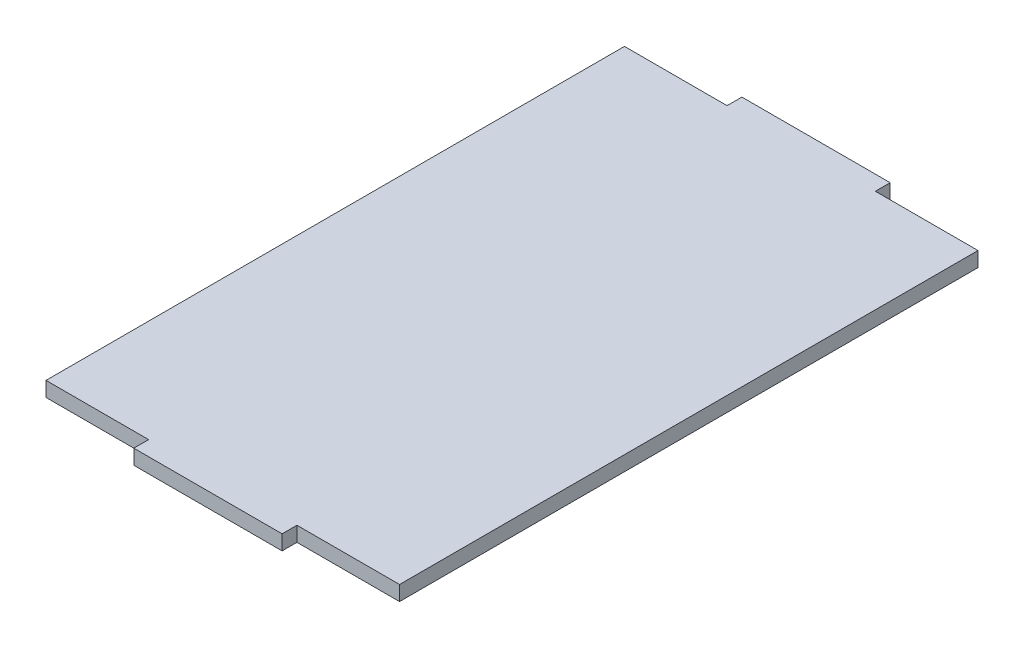
ISO-10303-21;
HEADER;
FILE_DESCRIPTION(('STEP AP214'),'2;1');
FILE_NAME('part.step','',(''),(''),'','','');
FILE_SCHEMA(('AUTOMOTIVE_DESIGN { 1 0 10303 214 1 1 1 1 }'));
ENDSEC;
DATA;
#1=APPLICATION_CONTEXT('core data for automotive mechanical design processes');
#2=APPLICATION_PROTOCOL_DEFINITION('international standard','automotive_design',2000,#1);
#3=PRODUCT_CONTEXT('',#1,'mechanical');
#4=PRODUCT('Part','Part','',(#3));
#5=PRODUCT_RELATED_PRODUCT_CATEGORY('part','',(#4));
#6=PRODUCT_DEFINITION_FORMATION('','',#4);
#7=PRODUCT_DEFINITION_CONTEXT('part definition',#1,'design');
#8=PRODUCT_DEFINITION('design','',#6,#7);
#9=PRODUCT_DEFINITION_SHAPE('','',#8);
#10=(LENGTH_UNIT() NAMED_UNIT(*) SI_UNIT(.MILLI.,.METRE.));
#11=(NAMED_UNIT(*) PLANE_ANGLE_UNIT() SI_UNIT($,.RADIAN.));
#12=(NAMED_UNIT(*) SI_UNIT($,.STERADIAN.) SOLID_ANGLE_UNIT());
#13=UNCERTAINTY_MEASURE_WITH_UNIT(LENGTH_MEASURE(1.E-05),#10,'distance_accuracy_value','');
#14=(GEOMETRIC_REPRESENTATION_CONTEXT(3) GLOBAL_UNCERTAINTY_ASSIGNED_CONTEXT((#13)) GLOBAL_UNIT_ASSIGNED_CONTEXT((#10,
#11,#12)) REPRESENTATION_CONTEXT('',''));
#15=CARTESIAN_POINT('',(0.,0.,0.));
#16=DIRECTION('',(0.,0.,1.));
#17=DIRECTION('',(1.,0.,0.));
#18=AXIS2_PLACEMENT_3D('',#15,#16,#17);
#19=CARTESIAN_POINT('',(-38.1561117317202,3.,-26.188327609225));
#20=DIRECTION('',(1.,0.,0.));
#21=DIRECTION('',(0.,0.,-1.));
#22=AXIS2_PLACEMENT_3D('',#19,#20,#21);
#23=PLANE('',#22);
#24=DIRECTION('',(0.,0.,1.));
#25=VECTOR('',#24,1.);
#26=CARTESIAN_POINT('',(-38.1561117317202,0.,-26.188327609225));
#27=LINE('',#26,#25);
#28=CARTESIAN_POINT('',(-38.1561117317202,0.,-26.188327609225));
#29=VERTEX_POINT('',#28);
#30=CARTESIAN_POINT('',(-38.1561117317202,0.,90.811672390775));
#31=VERTEX_POINT('',#30);
#32=EDGE_CURVE('E152',#29,#31,#27,.T.);
#33=ORIENTED_EDGE('',*,*,#32,.T.);
#34=DIRECTION('',(0.,-1.,0.));
#35=VECTOR('',#34,1.);
#36=CARTESIAN_POINT('',(-38.1561117317202,3.,90.811672390775));
#37=LINE('',#36,#35);
#38=CARTESIAN_POINT('',(-38.1561117317202,3.,90.811672390775));
#39=VERTEX_POINT('',#38);
#40=EDGE_CURVE('E11',#39,#31,#37,.T.);
#41=ORIENTED_EDGE('',*,*,#40,.F.);
#42=DIRECTION('',(0.,0.,1.));
#43=VECTOR('',#42,1.);
#44=CARTESIAN_POINT('',(-38.1561117317202,3.,-26.188327609225));
#45=LINE('',#44,#43);
#46=CARTESIAN_POINT('',(-38.1561117317202,3.,-26.188327609225));
#47=VERTEX_POINT('',#46);
#48=EDGE_CURVE('E174',#47,#39,#45,.T.);
#49=ORIENTED_EDGE('',*,*,#48,.F.);
#50=DIRECTION('',(0.,-1.,0.));
#51=VECTOR('',#50,1.);
#52=CARTESIAN_POINT('',(-38.1561117317202,3.,-26.188327609225));
#53=LINE('',#52,#51);
#54=EDGE_CURVE('E148',#47,#29,#53,.T.);
#55=ORIENTED_EDGE('',*,*,#54,.T.);
#56=EDGE_LOOP('',(#33,#41,#49,#55));
#57=FACE_BOUND('',#56,.T.);
#58=ADVANCED_FACE('F32',(#57),#23,.F.);
#59=CARTESIAN_POINT('',(-38.1561117317202,3.,90.811672390775));
#60=DIRECTION('',(0.,0.,-1.));
#61=DIRECTION('',(-1.,0.,0.));
#62=AXIS2_PLACEMENT_3D('',#59,#60,#61);
#63=PLANE('',#62);
#64=DIRECTION('',(1.,0.,0.));
#65=VECTOR('',#64,1.);
#66=CARTESIAN_POINT('',(-38.1561117317202,0.,90.811672390775));
#67=LINE('',#66,#65);
#68=CARTESIAN_POINT('',(-17.4011117317202,0.,90.811672390775));
#69=VERTEX_POINT('',#68);
#70=EDGE_CURVE('E155',#31,#69,#67,.T.);
#71=ORIENTED_EDGE('',*,*,#70,.T.);
#72=DIRECTION('',(0.,-1.,0.));
#73=VECTOR('',#72,1.);
#74=CARTESIAN_POINT('',(-17.4011117317202,3.,90.811672390775));
#75=LINE('',#74,#73);
#76=CARTESIAN_POINT('',(-17.4011117317202,3.,90.811672390775));
#77=VERTEX_POINT('',#76);
#78=EDGE_CURVE('E40',#77,#69,#75,.T.);
#79=ORIENTED_EDGE('',*,*,#78,.F.);
#80=DIRECTION('',(1.,0.,0.));
#81=VECTOR('',#80,1.);
#82=CARTESIAN_POINT('',(-38.1561117317202,3.,90.811672390775));
#83=LINE('',#82,#81);
#84=EDGE_CURVE('E103',#39,#77,#83,.T.);
#85=ORIENTED_EDGE('',*,*,#84,.F.);
#86=ORIENTED_EDGE('',*,*,#40,.T.);
#87=EDGE_LOOP('',(#71,#79,#85,#86));
#88=FACE_BOUND('',#87,.T.);
#89=ADVANCED_FACE('F252',(#88),#63,.F.);
#90=CARTESIAN_POINT('',(-17.4011117317202,3.,90.811672390775));
#91=DIRECTION('',(1.,0.,0.));
#92=DIRECTION('',(0.,0.,-1.));
#93=AXIS2_PLACEMENT_3D('',#90,#91,#92);
#94=PLANE('',#93);
#95=DIRECTION('',(0.,0.,1.));
#96=VECTOR('',#95,1.);
#97=CARTESIAN_POINT('',(-17.4011117317202,0.,90.811672390775));
#98=LINE('',#97,#96);
#99=CARTESIAN_POINT('',(-17.4011117317202,0.,93.811672390775));
#100=VERTEX_POINT('',#99);
#101=EDGE_CURVE('E157',#69,#100,#98,.T.);
#102=ORIENTED_EDGE('',*,*,#101,.T.);
#103=DIRECTION('',(0.,-1.,0.));
#104=VECTOR('',#103,1.);
#105=CARTESIAN_POINT('',(-17.4011117317202,3.,93.811672390775));
#106=LINE('',#105,#104);
#107=CARTESIAN_POINT('',(-17.4011117317202,3.,93.811672390775));
#108=VERTEX_POINT('',#107);
#109=EDGE_CURVE('E193',#108,#100,#106,.T.);
#110=ORIENTED_EDGE('',*,*,#109,.F.);
#111=DIRECTION('',(0.,0.,1.));
#112=VECTOR('',#111,1.);
#113=CARTESIAN_POINT('',(-17.4011117317202,3.,90.811672390775));
#114=LINE('',#113,#112);
#115=EDGE_CURVE('E201',#77,#108,#114,.T.);
#116=ORIENTED_EDGE('',*,*,#115,.F.);
#117=ORIENTED_EDGE('',*,*,#78,.T.);
#118=EDGE_LOOP('',(#102,#110,#116,#117));
#119=FACE_BOUND('',#118,.T.);
#120=ADVANCED_FACE('F199',(#119),#94,.F.);
#121=CARTESIAN_POINT('',(-17.4011117317202,3.,93.811672390775));
#122=DIRECTION('',(0.,0.,-1.));
#123=DIRECTION('',(-1.,0.,0.));
#124=AXIS2_PLACEMENT_3D('',#121,#122,#123);
#125=PLANE('',#124);
#126=DIRECTION('',(1.,0.,0.));
#127=VECTOR('',#126,1.);
#128=CARTESIAN_POINT('',(-17.4011117317202,0.,93.811672390775));
#129=LINE('',#128,#127);
#130=CARTESIAN_POINT('',(12.5988882682798,0.,93.811672390775));
#131=VERTEX_POINT('',#130);
#132=EDGE_CURVE('E159',#100,#131,#129,.T.);
#133=ORIENTED_EDGE('',*,*,#132,.T.);
#134=DIRECTION('',(0.,-1.,0.));
#135=VECTOR('',#134,1.);
#136=CARTESIAN_POINT('',(12.5988882682798,3.,93.811672390775));
#137=LINE('',#136,#135);
#138=CARTESIAN_POINT('',(12.5988882682798,3.,93.811672390775));
#139=VERTEX_POINT('',#138);
#140=EDGE_CURVE('E190',#139,#131,#137,.T.);
#141=ORIENTED_EDGE('',*,*,#140,.F.);
#142=DIRECTION('',(1.,0.,0.));
#143=VECTOR('',#142,1.);
#144=CARTESIAN_POINT('',(-17.4011117317202,3.,93.811672390775));
#145=LINE('',#144,#143);
#146=EDGE_CURVE('E219',#108,#139,#145,.T.);
#147=ORIENTED_EDGE('',*,*,#146,.F.);
#148=ORIENTED_EDGE('',*,*,#109,.T.);
#149=EDGE_LOOP('',(#133,#141,#147,#148));
#150=FACE_BOUND('',#149,.T.);
#151=ADVANCED_FACE('F210',(#150),#125,.F.);
#152=CARTESIAN_POINT('',(12.5988882682798,3.,90.811672390775));
#153=DIRECTION('',(-1.,0.,0.));
#154=DIRECTION('',(0.,0.,1.));
#155=AXIS2_PLACEMENT_3D('',#152,#153,#154);
#156=PLANE('',#155);
#157=DIRECTION('',(0.,0.,-1.));
#158=VECTOR('',#157,1.);
#159=CARTESIAN_POINT('',(12.5988882682798,0.,90.811672390775));
#160=LINE('',#159,#158);
#161=CARTESIAN_POINT('',(12.5988882682798,0.,90.811672390775));
#162=VERTEX_POINT('',#161);
#163=EDGE_CURVE('E161',#131,#162,#160,.T.);
#164=ORIENTED_EDGE('',*,*,#163,.T.);
#165=DIRECTION('',(0.,-1.,0.));
#166=VECTOR('',#165,1.);
#167=CARTESIAN_POINT('',(12.5988882682798,3.,90.811672390775));
#168=LINE('',#167,#166);
#169=CARTESIAN_POINT('',(12.5988882682798,3.,90.811672390775));
#170=VERTEX_POINT('',#169);
#171=EDGE_CURVE('E187',#170,#162,#168,.T.);
#172=ORIENTED_EDGE('',*,*,#171,.F.);
#173=DIRECTION('',(0.,0.,-1.));
#174=VECTOR('',#173,1.);
#175=CARTESIAN_POINT('',(12.5988882682798,3.,90.811672390775));
#176=LINE('',#175,#174);
#177=EDGE_CURVE('E216',#139,#170,#176,.T.);
#178=ORIENTED_EDGE('',*,*,#177,.F.);
#179=ORIENTED_EDGE('',*,*,#140,.T.);
#180=EDGE_LOOP('',(#164,#172,#178,#179));
#181=FACE_BOUND('',#180,.T.);
#182=ADVANCED_FACE('F214',(#181),#156,.F.);
#183=CARTESIAN_POINT('',(12.5988882682798,3.,90.811672390775));
#184=DIRECTION('',(0.,0.,-1.));
#185=DIRECTION('',(-1.,0.,0.));
#186=AXIS2_PLACEMENT_3D('',#183,#184,#185);
#187=PLANE('',#186);
#188=DIRECTION('',(1.,0.,0.));
#189=VECTOR('',#188,1.);
#190=CARTESIAN_POINT('',(12.5988882682798,0.,90.811672390775));
#191=LINE('',#190,#189);
#192=CARTESIAN_POINT('',(33.3538882682798,0.,90.811672390775));
#193=VERTEX_POINT('',#192);
#194=EDGE_CURVE('E163',#162,#193,#191,.T.);
#195=ORIENTED_EDGE('',*,*,#194,.T.);
#196=DIRECTION('',(0.,-1.,0.));
#197=VECTOR('',#196,1.);
#198=CARTESIAN_POINT('',(33.3538882682798,3.,90.811672390775));
#199=LINE('',#198,#197);
#200=CARTESIAN_POINT('',(33.3538882682798,3.,90.811672390775));
#201=VERTEX_POINT('',#200);
#202=EDGE_CURVE('E184',#201,#193,#199,.T.);
#203=ORIENTED_EDGE('',*,*,#202,.F.);
#204=DIRECTION('',(1.,0.,0.));
#205=VECTOR('',#204,1.);
#206=CARTESIAN_POINT('',(12.5988882682798,3.,90.811672390775));
#207=LINE('',#206,#205);
#208=EDGE_CURVE('E218',#170,#201,#207,.T.);
#209=ORIENTED_EDGE('',*,*,#208,.F.);
#210=ORIENTED_EDGE('',*,*,#171,.T.);
#211=EDGE_LOOP('',(#195,#203,#209,#210));
#212=FACE_BOUND('',#211,.T.);
#213=ADVANCED_FACE('F265',(#212),#187,.F.);
#214=CARTESIAN_POINT('',(33.3538882682798,3.,-26.188327609225));
#215=DIRECTION('',(-1.,0.,0.));
#216=DIRECTION('',(0.,0.,1.));
#217=AXIS2_PLACEMENT_3D('',#214,#215,#216);
#218=PLANE('',#217);
#219=DIRECTION('',(0.,0.,-1.));
#220=VECTOR('',#219,1.);
#221=CARTESIAN_POINT('',(33.3538882682798,0.,-26.188327609225));
#222=LINE('',#221,#220);
#223=CARTESIAN_POINT('',(33.3538882682798,0.,-26.188327609225));
#224=VERTEX_POINT('',#223);
#225=EDGE_CURVE('E165',#193,#224,#222,.T.);
#226=ORIENTED_EDGE('',*,*,#225,.T.);
#227=DIRECTION('',(0.,-1.,0.));
#228=VECTOR('',#227,1.);
#229=CARTESIAN_POINT('',(33.3538882682798,3.,-26.188327609225));
#230=LINE('',#229,#228);
#231=CARTESIAN_POINT('',(33.3538882682798,3.,-26.188327609225));
#232=VERTEX_POINT('',#231);
#233=EDGE_CURVE('E181',#232,#224,#230,.T.);
#234=ORIENTED_EDGE('',*,*,#233,.F.);
#235=DIRECTION('',(0.,0.,-1.));
#236=VECTOR('',#235,1.);
#237=CARTESIAN_POINT('',(33.3538882682798,3.,-26.188327609225));
#238=LINE('',#237,#236);
#239=EDGE_CURVE('E221',#201,#232,#238,.T.);
#240=ORIENTED_EDGE('',*,*,#239,.F.);
#241=ORIENTED_EDGE('',*,*,#202,.T.);
#242=EDGE_LOOP('',(#226,#234,#240,#241));
#243=FACE_BOUND('',#242,.T.);
#244=ADVANCED_FACE('F268',(#243),#218,.F.);
#245=CARTESIAN_POINT('',(12.5988882682798,3.,-26.188327609225));
#246=DIRECTION('',(0.,0.,1.));
#247=DIRECTION('',(1.,0.,0.));
#248=AXIS2_PLACEMENT_3D('',#245,#246,#247);
#249=PLANE('',#248);
#250=DIRECTION('',(-1.,0.,0.));
#251=VECTOR('',#250,1.);
#252=CARTESIAN_POINT('',(12.5988882682798,0.,-26.188327609225));
#253=LINE('',#252,#251);
#254=CARTESIAN_POINT('',(12.5988882682798,0.,-26.188327609225));
#255=VERTEX_POINT('',#254);
#256=EDGE_CURVE('E167',#224,#255,#253,.T.);
#257=ORIENTED_EDGE('',*,*,#256,.T.);
#258=DIRECTION('',(0.,-1.,0.));
#259=VECTOR('',#258,1.);
#260=CARTESIAN_POINT('',(12.5988882682798,3.,-26.188327609225));
#261=LINE('',#260,#259);
#262=CARTESIAN_POINT('',(12.5988882682798,3.,-26.188327609225));
#263=VERTEX_POINT('',#262);
#264=EDGE_CURVE('E178',#263,#255,#261,.T.);
#265=ORIENTED_EDGE('',*,*,#264,.F.);
#266=DIRECTION('',(-1.,0.,0.));
#267=VECTOR('',#266,1.);
#268=CARTESIAN_POINT('',(12.5988882682798,3.,-26.188327609225));
#269=LINE('',#268,#267);
#270=EDGE_CURVE('E227',#232,#263,#269,.T.);
#271=ORIENTED_EDGE('',*,*,#270,.F.);
#272=ORIENTED_EDGE('',*,*,#233,.T.);
#273=EDGE_LOOP('',(#257,#265,#271,#272));
#274=FACE_BOUND('',#273,.T.);
#275=ADVANCED_FACE('F233',(#274),#249,.F.);
#276=CARTESIAN_POINT('',(12.5988882682798,3.,-29.188327609225));
#277=DIRECTION('',(-1.,0.,0.));
#278=DIRECTION('',(0.,0.,1.));
#279=AXIS2_PLACEMENT_3D('',#276,#277,#278);
#280=PLANE('',#279);
#281=DIRECTION('',(0.,0.,-1.));
#282=VECTOR('',#281,1.);
#283=CARTESIAN_POINT('',(12.5988882682798,0.,-29.188327609225));
#284=LINE('',#283,#282);
#285=CARTESIAN_POINT('',(12.5988882682798,0.,-29.188327609225));
#286=VERTEX_POINT('',#285);
#287=EDGE_CURVE('E169',#255,#286,#284,.T.);
#288=ORIENTED_EDGE('',*,*,#287,.T.);
#289=DIRECTION('',(0.,-1.,0.));
#290=VECTOR('',#289,1.);
#291=CARTESIAN_POINT('',(12.5988882682798,3.,-29.188327609225));
#292=LINE('',#291,#290);
#293=CARTESIAN_POINT('',(12.5988882682798,3.,-29.188327609225));
#294=VERTEX_POINT('',#293);
#295=EDGE_CURVE('E143',#294,#286,#292,.T.);
#296=ORIENTED_EDGE('',*,*,#295,.F.);
#297=DIRECTION('',(0.,0.,-1.));
#298=VECTOR('',#297,1.);
#299=CARTESIAN_POINT('',(12.5988882682798,3.,-29.188327609225));
#300=LINE('',#299,#298);
#301=EDGE_CURVE('E134',#263,#294,#300,.T.);
#302=ORIENTED_EDGE('',*,*,#301,.F.);
#303=ORIENTED_EDGE('',*,*,#264,.T.);
#304=EDGE_LOOP('',(#288,#296,#302,#303));
#305=FACE_BOUND('',#304,.T.);
#306=ADVANCED_FACE('F237',(#305),#280,.F.);
#307=CARTESIAN_POINT('',(-17.4011117317202,3.,-29.188327609225));
#308=DIRECTION('',(0.,0.,1.));
#309=DIRECTION('',(1.,0.,0.));
#310=AXIS2_PLACEMENT_3D('',#307,#308,#309);
#311=PLANE('',#310);
#312=DIRECTION('',(-1.,0.,0.));
#313=VECTOR('',#312,1.);
#314=CARTESIAN_POINT('',(-17.4011117317202,0.,-29.188327609225));
#315=LINE('',#314,#313);
#316=CARTESIAN_POINT('',(-17.4011117317202,0.,-29.188327609225));
#317=VERTEX_POINT('',#316);
#318=EDGE_CURVE('E142',#286,#317,#315,.T.);
#319=ORIENTED_EDGE('',*,*,#318,.T.);
#320=DIRECTION('',(0.,-1.,0.));
#321=VECTOR('',#320,1.);
#322=CARTESIAN_POINT('',(-17.4011117317202,3.,-29.188327609225));
#323=LINE('',#322,#321);
#324=CARTESIAN_POINT('',(-17.4011117317202,3.,-29.188327609225));
#325=VERTEX_POINT('',#324);
#326=EDGE_CURVE('E139',#325,#317,#323,.T.);
#327=ORIENTED_EDGE('',*,*,#326,.F.);
#328=DIRECTION('',(-1.,0.,0.));
#329=VECTOR('',#328,1.);
#330=CARTESIAN_POINT('',(-17.4011117317202,3.,-29.188327609225));
#331=LINE('',#330,#329);
#332=EDGE_CURVE('E128',#294,#325,#331,.T.);
#333=ORIENTED_EDGE('',*,*,#332,.F.);
#334=ORIENTED_EDGE('',*,*,#295,.T.);
#335=EDGE_LOOP('',(#319,#327,#333,#334));
#336=FACE_BOUND('',#335,.T.);
#337=ADVANCED_FACE('F140',(#336),#311,.F.);
#338=CARTESIAN_POINT('',(-17.4011117317202,3.,-29.188327609225));
#339=DIRECTION('',(1.,0.,0.));
#340=DIRECTION('',(0.,0.,-1.));
#341=AXIS2_PLACEMENT_3D('',#338,#339,#340);
#342=PLANE('',#341);
#343=DIRECTION('',(0.,0.,1.));
#344=VECTOR('',#343,1.);
#345=CARTESIAN_POINT('',(-17.4011117317202,0.,-29.188327609225));
#346=LINE('',#345,#344);
#347=CARTESIAN_POINT('',(-17.4011117317202,0.,-26.188327609225));
#348=VERTEX_POINT('',#347);
#349=EDGE_CURVE('E89',#317,#348,#346,.T.);
#350=ORIENTED_EDGE('',*,*,#349,.T.);
#351=DIRECTION('',(0.,-1.,0.));
#352=VECTOR('',#351,1.);
#353=CARTESIAN_POINT('',(-17.4011117317202,3.,-26.188327609225));
#354=LINE('',#353,#352);
#355=CARTESIAN_POINT('',(-17.4011117317202,3.,-26.188327609225));
#356=VERTEX_POINT('',#355);
#357=EDGE_CURVE('E144',#356,#348,#354,.T.);
#358=ORIENTED_EDGE('',*,*,#357,.F.);
#359=DIRECTION('',(0.,0.,1.));
#360=VECTOR('',#359,1.);
#361=CARTESIAN_POINT('',(-17.4011117317202,3.,-29.188327609225));
#362=LINE('',#361,#360);
#363=EDGE_CURVE('E132',#325,#356,#362,.T.);
#364=ORIENTED_EDGE('',*,*,#363,.F.);
#365=ORIENTED_EDGE('',*,*,#326,.T.);
#366=EDGE_LOOP('',(#350,#358,#364,#365));
#367=FACE_BOUND('',#366,.T.);
#368=ADVANCED_FACE('F146',(#367),#342,.F.);
#369=CARTESIAN_POINT('',(-38.1561117317202,3.,-26.188327609225));
#370=DIRECTION('',(0.,0.,1.));
#371=DIRECTION('',(1.,0.,0.));
#372=AXIS2_PLACEMENT_3D('',#369,#370,#371);
#373=PLANE('',#372);
#374=DIRECTION('',(-1.,0.,0.));
#375=VECTOR('',#374,1.);
#376=CARTESIAN_POINT('',(-38.1561117317202,0.,-26.188327609225));
#377=LINE('',#376,#375);
#378=EDGE_CURVE('E95',#348,#29,#377,.T.);
#379=ORIENTED_EDGE('',*,*,#378,.T.);
#380=ORIENTED_EDGE('',*,*,#54,.F.);
#381=DIRECTION('',(-1.,0.,0.));
#382=VECTOR('',#381,1.);
#383=CARTESIAN_POINT('',(-38.1561117317202,3.,-26.188327609225));
#384=LINE('',#383,#382);
#385=EDGE_CURVE('E48',#356,#47,#384,.T.);
#386=ORIENTED_EDGE('',*,*,#385,.F.);
#387=ORIENTED_EDGE('',*,*,#357,.T.);
#388=EDGE_LOOP('',(#379,#380,#386,#387));
#389=FACE_BOUND('',#388,.T.);
#390=ADVANCED_FACE('F241',(#389),#373,.F.);
#391=CARTESIAN_POINT('',(0.,3.,0.));
#392=DIRECTION('',(0.,1.,0.));
#393=DIRECTION('',(0.,0.,1.));
#394=AXIS2_PLACEMENT_3D('',#391,#392,#393);
#395=PLANE('',#394);
#396=ORIENTED_EDGE('',*,*,#48,.T.);
#397=ORIENTED_EDGE('',*,*,#84,.T.);
#398=ORIENTED_EDGE('',*,*,#115,.T.);
#399=ORIENTED_EDGE('',*,*,#146,.T.);
#400=ORIENTED_EDGE('',*,*,#177,.T.);
#401=ORIENTED_EDGE('',*,*,#208,.T.);
#402=ORIENTED_EDGE('',*,*,#239,.T.);
#403=ORIENTED_EDGE('',*,*,#270,.T.);
#404=ORIENTED_EDGE('',*,*,#301,.T.);
#405=ORIENTED_EDGE('',*,*,#332,.T.);
#406=ORIENTED_EDGE('',*,*,#363,.T.);
#407=ORIENTED_EDGE('',*,*,#385,.T.);
#408=EDGE_LOOP('',(#396,#397,#398,#399,#400,#401,#402,#403,#404,#405,#406,#407));
#409=FACE_BOUND('',#408,.T.);
#410=ADVANCED_FACE('F130',(#409),#395,.T.);
#411=CARTESIAN_POINT('',(0.,0.,0.));
#412=DIRECTION('',(0.,1.,0.));
#413=DIRECTION('',(0.,0.,1.));
#414=AXIS2_PLACEMENT_3D('',#411,#412,#413);
#415=PLANE('',#414);
#416=ORIENTED_EDGE('',*,*,#32,.F.);
#417=ORIENTED_EDGE('',*,*,#378,.F.);
#418=ORIENTED_EDGE('',*,*,#349,.F.);
#419=ORIENTED_EDGE('',*,*,#318,.F.);
#420=ORIENTED_EDGE('',*,*,#287,.F.);
#421=ORIENTED_EDGE('',*,*,#256,.F.);
#422=ORIENTED_EDGE('',*,*,#225,.F.);
#423=ORIENTED_EDGE('',*,*,#194,.F.);
#424=ORIENTED_EDGE('',*,*,#163,.F.);
#425=ORIENTED_EDGE('',*,*,#132,.F.);
#426=ORIENTED_EDGE('',*,*,#101,.F.);
#427=ORIENTED_EDGE('',*,*,#70,.F.);
#428=EDGE_LOOP('',(#416,#417,#418,#419,#420,#421,#422,#423,#424,#425,#426,#427));
#429=FACE_BOUND('',#428,.T.);
#430=ADVANCED_FACE('F205',(#429),#415,.F.);
#431=CLOSED_SHELL('',(#58,#89,#120,#151,#182,#213,#244,#275,#306,#337,#368,#390,#410,#430));
#432=MANIFOLD_SOLID_BREP('B2',#431);
#433=ADVANCED_BREP_SHAPE_REPRESENTATION('',(#18,#432),#14);
#434=SHAPE_DEFINITION_REPRESENTATION(#9,#433);
ENDSEC;
END-ISO-10303-21;
